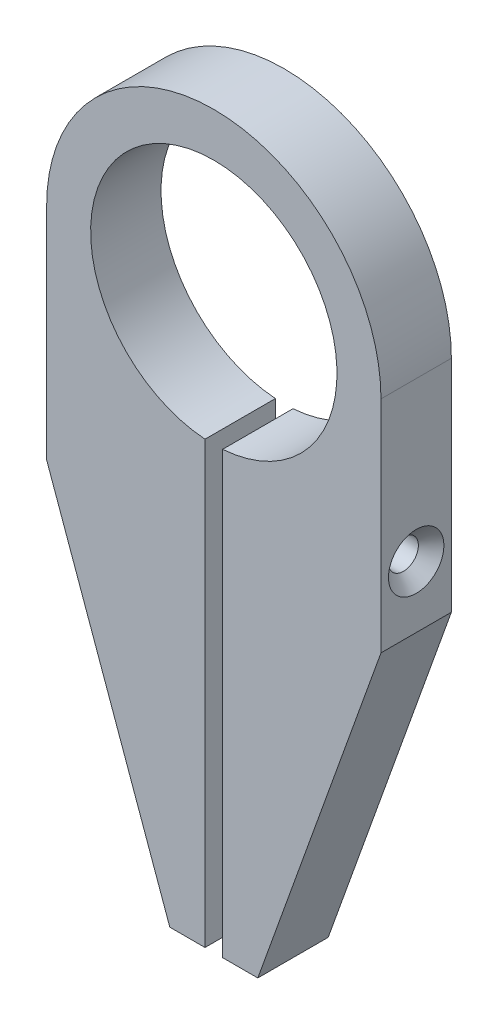
ISO-10303-21;
HEADER;
FILE_DESCRIPTION(('STEP AP214'),'2;1');
FILE_NAME('part.step','',(''),(''),'','','');
FILE_SCHEMA(('AUTOMOTIVE_DESIGN { 1 0 10303 214 1 1 1 1 }'));
ENDSEC;
DATA;
#1=APPLICATION_CONTEXT('core data for automotive mechanical design processes');
#2=APPLICATION_PROTOCOL_DEFINITION('international standard','automotive_design',2000,#1);
#3=PRODUCT_CONTEXT('',#1,'mechanical');
#4=PRODUCT('Part','Part','',(#3));
#5=PRODUCT_RELATED_PRODUCT_CATEGORY('part','',(#4));
#6=PRODUCT_DEFINITION_FORMATION('','',#4);
#7=PRODUCT_DEFINITION_CONTEXT('part definition',#1,'design');
#8=PRODUCT_DEFINITION('design','',#6,#7);
#9=PRODUCT_DEFINITION_SHAPE('','',#8);
#10=(LENGTH_UNIT() NAMED_UNIT(*) SI_UNIT(.MILLI.,.METRE.));
#11=(NAMED_UNIT(*) PLANE_ANGLE_UNIT() SI_UNIT($,.RADIAN.));
#12=(NAMED_UNIT(*) SI_UNIT($,.STERADIAN.) SOLID_ANGLE_UNIT());
#13=UNCERTAINTY_MEASURE_WITH_UNIT(LENGTH_MEASURE(1.E-05),#10,'distance_accuracy_value','');
#14=(GEOMETRIC_REPRESENTATION_CONTEXT(3) GLOBAL_UNCERTAINTY_ASSIGNED_CONTEXT((#13)) GLOBAL_UNIT_ASSIGNED_CONTEXT((#10,
#11,#12)) REPRESENTATION_CONTEXT('',''));
#15=CARTESIAN_POINT('',(0.,0.,0.));
#16=DIRECTION('',(0.,0.,1.));
#17=DIRECTION('',(1.,0.,0.));
#18=AXIS2_PLACEMENT_3D('',#15,#16,#17);
#19=CARTESIAN_POINT('',(-19.,0.,8.));
#20=DIRECTION('',(1.,0.,0.));
#21=DIRECTION('',(0.,1.,0.));
#22=AXIS2_PLACEMENT_3D('',#19,#20,#21);
#23=PLANE('',#22);
#24=DIRECTION('',(0.,-1.,0.));
#25=VECTOR('',#24,1.);
#26=CARTESIAN_POINT('',(-19.,0.,0.));
#27=LINE('',#26,#25);
#28=CARTESIAN_POINT('',(-19.,0.,0.));
#29=VERTEX_POINT('',#28);
#30=CARTESIAN_POINT('',(-19.,-25.,0.));
#31=VERTEX_POINT('',#30);
#32=EDGE_CURVE('E147',#29,#31,#27,.T.);
#33=ORIENTED_EDGE('',*,*,#32,.T.);
#34=DIRECTION('',(0.,0.,-1.));
#35=VECTOR('',#34,1.);
#36=CARTESIAN_POINT('',(-19.,-25.,8.));
#37=LINE('',#36,#35);
#38=CARTESIAN_POINT('',(-19.,-25.,8.));
#39=VERTEX_POINT('',#38);
#40=EDGE_CURVE('E144',#39,#31,#37,.T.);
#41=ORIENTED_EDGE('',*,*,#40,.F.);
#42=DIRECTION('',(0.,-1.,0.));
#43=VECTOR('',#42,1.);
#44=CARTESIAN_POINT('',(-19.,0.,8.));
#45=LINE('',#44,#43);
#46=CARTESIAN_POINT('',(-19.,0.,8.));
#47=VERTEX_POINT('',#46);
#48=EDGE_CURVE('E132',#47,#39,#45,.T.);
#49=ORIENTED_EDGE('',*,*,#48,.F.);
#50=DIRECTION('',(0.,0.,-1.));
#51=VECTOR('',#50,1.);
#52=CARTESIAN_POINT('',(-19.,0.,8.));
#53=LINE('',#52,#51);
#54=EDGE_CURVE('E148',#47,#29,#53,.T.);
#55=ORIENTED_EDGE('',*,*,#54,.T.);
#56=EDGE_LOOP('',(#33,#41,#49,#55));
#57=FACE_BOUND('',#56,.T.);
#58=CARTESIAN_POINT('',(-19.,-18.,4.));
#59=DIRECTION('',(-1.,0.,0.));
#60=DIRECTION('',(0.,0.,1.));
#61=AXIS2_PLACEMENT_3D('',#58,#59,#60);
#62=CIRCLE('',#61,1.24999999999999);
#63=CARTESIAN_POINT('',(-19.,-18.,5.24999999999999));
#64=VERTEX_POINT('',#63);
#65=EDGE_CURVE('E273',#64,#64,#62,.T.);
#66=ORIENTED_EDGE('',*,*,#65,.F.);
#67=EDGE_LOOP('',(#66));
#68=FACE_BOUND('',#67,.T.);
#69=ADVANCED_FACE('F50',(#57,#68),#23,.F.);
#70=CARTESIAN_POINT('',(-1.,0.,8.));
#71=DIRECTION('',(1.,0.,0.));
#72=DIRECTION('',(0.,1.,0.));
#73=AXIS2_PLACEMENT_3D('',#70,#71,#72);
#74=PLANE('',#73);
#75=CARTESIAN_POINT('',(-0.999999999999997,-18.,4.));
#76=DIRECTION('',(1.,0.,0.));
#77=DIRECTION('',(0.,1.,0.));
#78=AXIS2_PLACEMENT_3D('',#75,#76,#77);
#79=CIRCLE('',#78,1.24999999999999);
#80=CARTESIAN_POINT('',(-0.999999999999998,-16.75,4.));
#81=VERTEX_POINT('',#80);
#82=EDGE_CURVE('E276',#81,#81,#79,.T.);
#83=ORIENTED_EDGE('',*,*,#82,.F.);
#84=EDGE_LOOP('',(#83));
#85=FACE_BOUND('',#84,.T.);
#86=DIRECTION('',(0.,-1.,0.));
#87=VECTOR('',#86,1.);
#88=CARTESIAN_POINT('',(-1.,0.,0.));
#89=LINE('',#88,#87);
#90=CARTESIAN_POINT('',(-0.999999999999997,-13.9642400437689,0.));
#91=VERTEX_POINT('',#90);
#92=CARTESIAN_POINT('',(-0.999999999999984,-64.,0.));
#93=VERTEX_POINT('',#92);
#94=EDGE_CURVE('E156',#91,#93,#89,.T.);
#95=ORIENTED_EDGE('',*,*,#94,.F.);
#96=DIRECTION('',(0.,0.,-1.));
#97=VECTOR('',#96,1.);
#98=CARTESIAN_POINT('',(-0.999999999999997,-13.9642400437689,8.));
#99=LINE('',#98,#97);
#100=CARTESIAN_POINT('',(-0.999999999999997,-13.9642400437689,8.));
#101=VERTEX_POINT('',#100);
#102=EDGE_CURVE('E13',#101,#91,#99,.T.);
#103=ORIENTED_EDGE('',*,*,#102,.F.);
#104=DIRECTION('',(0.,-1.,0.));
#105=VECTOR('',#104,1.);
#106=CARTESIAN_POINT('',(-1.,0.,8.));
#107=LINE('',#106,#105);
#108=CARTESIAN_POINT('',(-0.999999999999984,-64.,8.));
#109=VERTEX_POINT('',#108);
#110=EDGE_CURVE('E181',#101,#109,#107,.T.);
#111=ORIENTED_EDGE('',*,*,#110,.T.);
#112=DIRECTION('',(0.,0.,-1.));
#113=VECTOR('',#112,1.);
#114=CARTESIAN_POINT('',(-0.999999999999984,-64.,8.));
#115=LINE('',#114,#113);
#116=EDGE_CURVE('E108',#109,#93,#115,.T.);
#117=ORIENTED_EDGE('',*,*,#116,.T.);
#118=EDGE_LOOP('',(#95,#103,#111,#117));
#119=FACE_BOUND('',#118,.T.);
#120=ADVANCED_FACE('F52',(#85,#119),#74,.T.);
#121=CARTESIAN_POINT('',(0.,0.,8.));
#122=DIRECTION('',(0.,0.,-1.));
#123=DIRECTION('',(-1.,0.,0.));
#124=AXIS2_PLACEMENT_3D('',#121,#122,#123);
#125=CYLINDRICAL_SURFACE('',#124,14.);
#126=CARTESIAN_POINT('',(0.,0.,0.));
#127=DIRECTION('',(0.,0.,1.));
#128=DIRECTION('',(1.,0.,0.));
#129=AXIS2_PLACEMENT_3D('',#126,#127,#128);
#130=CIRCLE('',#129,14.);
#131=CARTESIAN_POINT('',(1.,-13.9642400437689,0.));
#132=VERTEX_POINT('',#131);
#133=EDGE_CURVE('E159',#132,#91,#130,.T.);
#134=ORIENTED_EDGE('',*,*,#133,.F.);
#135=DIRECTION('',(0.,0.,-1.));
#136=VECTOR('',#135,1.);
#137=CARTESIAN_POINT('',(1.,-13.9642400437689,8.));
#138=LINE('',#137,#136);
#139=CARTESIAN_POINT('',(1.,-13.9642400437689,8.));
#140=VERTEX_POINT('',#139);
#141=EDGE_CURVE('E59',#140,#132,#138,.T.);
#142=ORIENTED_EDGE('',*,*,#141,.F.);
#143=CARTESIAN_POINT('',(0.,0.,8.));
#144=DIRECTION('',(0.,0.,1.));
#145=DIRECTION('',(1.,0.,0.));
#146=AXIS2_PLACEMENT_3D('',#143,#144,#145);
#147=CIRCLE('',#146,14.);
#148=EDGE_CURVE('E206',#140,#101,#147,.T.);
#149=ORIENTED_EDGE('',*,*,#148,.T.);
#150=ORIENTED_EDGE('',*,*,#102,.T.);
#151=EDGE_LOOP('',(#134,#142,#149,#150));
#152=FACE_BOUND('',#151,.T.);
#153=ADVANCED_FACE('F205',(#152),#125,.F.);
#154=CARTESIAN_POINT('',(1.,0.,8.));
#155=DIRECTION('',(1.,0.,0.));
#156=DIRECTION('',(0.,1.,0.));
#157=AXIS2_PLACEMENT_3D('',#154,#155,#156);
#158=PLANE('',#157);
#159=CARTESIAN_POINT('',(1.,-18.,4.));
#160=DIRECTION('',(1.,0.,0.));
#161=DIRECTION('',(0.,1.,0.));
#162=AXIS2_PLACEMENT_3D('',#159,#160,#161);
#163=CIRCLE('',#162,1.7);
#164=CARTESIAN_POINT('',(1.,-16.3,4.));
#165=VERTEX_POINT('',#164);
#166=EDGE_CURVE('E160',#165,#165,#163,.T.);
#167=ORIENTED_EDGE('',*,*,#166,.T.);
#168=EDGE_LOOP('',(#167));
#169=FACE_BOUND('',#168,.T.);
#170=DIRECTION('',(0.,-1.,0.));
#171=VECTOR('',#170,1.);
#172=CARTESIAN_POINT('',(1.,0.,0.));
#173=LINE('',#172,#171);
#174=CARTESIAN_POINT('',(1.00000000000001,-64.,0.));
#175=VERTEX_POINT('',#174);
#176=EDGE_CURVE('E163',#132,#175,#173,.T.);
#177=ORIENTED_EDGE('',*,*,#176,.T.);
#178=DIRECTION('',(0.,0.,-1.));
#179=VECTOR('',#178,1.);
#180=CARTESIAN_POINT('',(1.00000000000001,-64.,8.));
#181=LINE('',#180,#179);
#182=CARTESIAN_POINT('',(1.00000000000001,-64.,8.));
#183=VERTEX_POINT('',#182);
#184=EDGE_CURVE('E191',#183,#175,#181,.T.);
#185=ORIENTED_EDGE('',*,*,#184,.F.);
#186=DIRECTION('',(0.,-1.,0.));
#187=VECTOR('',#186,1.);
#188=CARTESIAN_POINT('',(1.,0.,8.));
#189=LINE('',#188,#187);
#190=EDGE_CURVE('E197',#140,#183,#189,.T.);
#191=ORIENTED_EDGE('',*,*,#190,.F.);
#192=ORIENTED_EDGE('',*,*,#141,.T.);
#193=EDGE_LOOP('',(#177,#185,#191,#192));
#194=FACE_BOUND('',#193,.T.);
#195=ADVANCED_FACE('F195',(#169,#194),#158,.F.);
#196=CARTESIAN_POINT('',(0.,-64.,8.));
#197=DIRECTION('',(0.,-1.,0.));
#198=DIRECTION('',(0.,0.,-1.));
#199=AXIS2_PLACEMENT_3D('',#196,#197,#198);
#200=PLANE('',#199);
#201=DIRECTION('',(-1.,0.,0.));
#202=VECTOR('',#201,1.);
#203=CARTESIAN_POINT('',(0.,-64.,0.));
#204=LINE('',#203,#202);
#205=CARTESIAN_POINT('',(5.00000000000001,-64.,0.));
#206=VERTEX_POINT('',#205);
#207=EDGE_CURVE('E166',#206,#175,#204,.T.);
#208=ORIENTED_EDGE('',*,*,#207,.F.);
#209=DIRECTION('',(0.,0.,-1.));
#210=VECTOR('',#209,1.);
#211=CARTESIAN_POINT('',(5.00000000000001,-64.,8.));
#212=LINE('',#211,#210);
#213=CARTESIAN_POINT('',(5.00000000000001,-64.,8.));
#214=VERTEX_POINT('',#213);
#215=EDGE_CURVE('E189',#214,#206,#212,.T.);
#216=ORIENTED_EDGE('',*,*,#215,.F.);
#217=DIRECTION('',(-1.,0.,0.));
#218=VECTOR('',#217,1.);
#219=CARTESIAN_POINT('',(0.,-64.,8.));
#220=LINE('',#219,#218);
#221=EDGE_CURVE('E216',#214,#183,#220,.T.);
#222=ORIENTED_EDGE('',*,*,#221,.T.);
#223=ORIENTED_EDGE('',*,*,#184,.T.);
#224=EDGE_LOOP('',(#208,#216,#222,#223));
#225=FACE_BOUND('',#224,.T.);
#226=ADVANCED_FACE('F290',(#225),#200,.T.);
#227=CARTESIAN_POINT('',(24.7810133954572,-8.89574839836924,8.));
#228=DIRECTION('',(0.941194670761707,-0.337864753606767,0.));
#229=DIRECTION('',(0.337864753606767,0.941194670761707,0.));
#230=AXIS2_PLACEMENT_3D('',#227,#228,#229);
#231=PLANE('',#230);
#232=DIRECTION('',(-0.337864753606767,-0.941194670761707,0.));
#233=VECTOR('',#232,1.);
#234=CARTESIAN_POINT('',(24.7810133954572,-8.89574839836924,0.));
#235=LINE('',#234,#233);
#236=CARTESIAN_POINT('',(19.,-25.,0.));
#237=VERTEX_POINT('',#236);
#238=EDGE_CURVE('E169',#237,#206,#235,.T.);
#239=ORIENTED_EDGE('',*,*,#238,.F.);
#240=DIRECTION('',(0.,0.,-1.));
#241=VECTOR('',#240,1.);
#242=CARTESIAN_POINT('',(19.,-25.,8.));
#243=LINE('',#242,#241);
#244=CARTESIAN_POINT('',(19.,-25.,8.));
#245=VERTEX_POINT('',#244);
#246=EDGE_CURVE('E187',#245,#237,#243,.T.);
#247=ORIENTED_EDGE('',*,*,#246,.F.);
#248=DIRECTION('',(-0.337864753606767,-0.941194670761707,0.));
#249=VECTOR('',#248,1.);
#250=CARTESIAN_POINT('',(24.7810133954572,-8.89574839836924,8.));
#251=LINE('',#250,#249);
#252=EDGE_CURVE('E219',#245,#214,#251,.T.);
#253=ORIENTED_EDGE('',*,*,#252,.T.);
#254=ORIENTED_EDGE('',*,*,#215,.T.);
#255=EDGE_LOOP('',(#239,#247,#253,#254));
#256=FACE_BOUND('',#255,.T.);
#257=ADVANCED_FACE('F231',(#256),#231,.T.);
#258=CARTESIAN_POINT('',(19.,0.,8.));
#259=DIRECTION('',(1.,0.,0.));
#260=DIRECTION('',(0.,1.,0.));
#261=AXIS2_PLACEMENT_3D('',#258,#259,#260);
#262=PLANE('',#261);
#263=CARTESIAN_POINT('',(19.,-18.,4.));
#264=DIRECTION('',(1.,0.,0.));
#265=DIRECTION('',(0.,0.,-1.));
#266=AXIS2_PLACEMENT_3D('',#263,#264,#265);
#267=CIRCLE('',#266,3.15);
#268=CARTESIAN_POINT('',(19.,-18.,0.85));
#269=VERTEX_POINT('',#268);
#270=EDGE_CURVE('E277',#269,#269,#267,.T.);
#271=ORIENTED_EDGE('',*,*,#270,.F.);
#272=EDGE_LOOP('',(#271));
#273=FACE_BOUND('',#272,.T.);
#274=DIRECTION('',(0.,-1.,0.));
#275=VECTOR('',#274,1.);
#276=CARTESIAN_POINT('',(19.,0.,0.));
#277=LINE('',#276,#275);
#278=CARTESIAN_POINT('',(19.,0.,0.));
#279=VERTEX_POINT('',#278);
#280=EDGE_CURVE('E172',#279,#237,#277,.T.);
#281=ORIENTED_EDGE('',*,*,#280,.F.);
#282=DIRECTION('',(0.,0.,-1.));
#283=VECTOR('',#282,1.);
#284=CARTESIAN_POINT('',(19.,0.,8.));
#285=LINE('',#284,#283);
#286=CARTESIAN_POINT('',(19.,0.,8.));
#287=VERTEX_POINT('',#286);
#288=EDGE_CURVE('E185',#287,#279,#285,.T.);
#289=ORIENTED_EDGE('',*,*,#288,.F.);
#290=DIRECTION('',(0.,-1.,0.));
#291=VECTOR('',#290,1.);
#292=CARTESIAN_POINT('',(19.,0.,8.));
#293=LINE('',#292,#291);
#294=EDGE_CURVE('E222',#287,#245,#293,.T.);
#295=ORIENTED_EDGE('',*,*,#294,.T.);
#296=ORIENTED_EDGE('',*,*,#246,.T.);
#297=EDGE_LOOP('',(#281,#289,#295,#296));
#298=FACE_BOUND('',#297,.T.);
#299=ADVANCED_FACE('F226',(#273,#298),#262,.T.);
#300=CARTESIAN_POINT('',(0.,0.,8.));
#301=DIRECTION('',(0.,0.,-1.));
#302=DIRECTION('',(-1.,0.,0.));
#303=AXIS2_PLACEMENT_3D('',#300,#301,#302);
#304=CYLINDRICAL_SURFACE('',#303,19.);
#305=CARTESIAN_POINT('',(0.,0.,0.));
#306=DIRECTION('',(0.,0.,1.));
#307=DIRECTION('',(1.,0.,0.));
#308=AXIS2_PLACEMENT_3D('',#305,#306,#307);
#309=CIRCLE('',#308,19.);
#310=EDGE_CURVE('E175',#279,#29,#309,.T.);
#311=ORIENTED_EDGE('',*,*,#310,.T.);
#312=ORIENTED_EDGE('',*,*,#54,.F.);
#313=CARTESIAN_POINT('',(0.,0.,8.));
#314=DIRECTION('',(0.,0.,1.));
#315=DIRECTION('',(1.,0.,0.));
#316=AXIS2_PLACEMENT_3D('',#313,#314,#315);
#317=CIRCLE('',#316,19.);
#318=EDGE_CURVE('E139',#287,#47,#317,.T.);
#319=ORIENTED_EDGE('',*,*,#318,.F.);
#320=ORIENTED_EDGE('',*,*,#288,.T.);
#321=EDGE_LOOP('',(#311,#312,#319,#320));
#322=FACE_BOUND('',#321,.T.);
#323=ADVANCED_FACE('F234',(#322),#304,.T.);
#324=CARTESIAN_POINT('',(-24.7810133954572,-8.89574839836924,8.));
#325=DIRECTION('',(0.941194670761708,0.337864753606766,0.));
#326=DIRECTION('',(-0.337864753606766,0.941194670761708,0.));
#327=AXIS2_PLACEMENT_3D('',#324,#325,#326);
#328=PLANE('',#327);
#329=DIRECTION('',(0.337864753606766,-0.941194670761708,0.));
#330=VECTOR('',#329,1.);
#331=CARTESIAN_POINT('',(-24.7810133954572,-8.89574839836924,0.));
#332=LINE('',#331,#330);
#333=CARTESIAN_POINT('',(-5.00000000000001,-64.,0.));
#334=VERTEX_POINT('',#333);
#335=EDGE_CURVE('E101',#31,#334,#332,.T.);
#336=ORIENTED_EDGE('',*,*,#335,.T.);
#337=DIRECTION('',(0.,0.,-1.));
#338=VECTOR('',#337,1.);
#339=CARTESIAN_POINT('',(-5.00000000000001,-64.,8.));
#340=LINE('',#339,#338);
#341=CARTESIAN_POINT('',(-5.00000000000001,-64.,8.));
#342=VERTEX_POINT('',#341);
#343=EDGE_CURVE('E149',#342,#334,#340,.T.);
#344=ORIENTED_EDGE('',*,*,#343,.F.);
#345=DIRECTION('',(0.337864753606766,-0.941194670761708,0.));
#346=VECTOR('',#345,1.);
#347=CARTESIAN_POINT('',(-24.7810133954572,-8.89574839836924,8.));
#348=LINE('',#347,#346);
#349=EDGE_CURVE('E136',#39,#342,#348,.T.);
#350=ORIENTED_EDGE('',*,*,#349,.F.);
#351=ORIENTED_EDGE('',*,*,#40,.T.);
#352=EDGE_LOOP('',(#336,#344,#350,#351));
#353=FACE_BOUND('',#352,.T.);
#354=ADVANCED_FACE('F151',(#353),#328,.F.);
#355=CARTESIAN_POINT('',(0.,-64.,8.));
#356=DIRECTION('',(0.,1.,0.));
#357=DIRECTION('',(0.,0.,1.));
#358=AXIS2_PLACEMENT_3D('',#355,#356,#357);
#359=PLANE('',#358);
#360=DIRECTION('',(1.,0.,0.));
#361=VECTOR('',#360,1.);
#362=CARTESIAN_POINT('',(0.,-64.,0.));
#363=LINE('',#362,#361);
#364=EDGE_CURVE('E179',#334,#93,#363,.T.);
#365=ORIENTED_EDGE('',*,*,#364,.T.);
#366=ORIENTED_EDGE('',*,*,#116,.F.);
#367=DIRECTION('',(1.,0.,0.));
#368=VECTOR('',#367,1.);
#369=CARTESIAN_POINT('',(0.,-64.,8.));
#370=LINE('',#369,#368);
#371=EDGE_CURVE('E67',#342,#109,#370,.T.);
#372=ORIENTED_EDGE('',*,*,#371,.F.);
#373=ORIENTED_EDGE('',*,*,#343,.T.);
#374=EDGE_LOOP('',(#365,#366,#372,#373));
#375=FACE_BOUND('',#374,.T.);
#376=ADVANCED_FACE('F209',(#375),#359,.F.);
#377=CARTESIAN_POINT('',(0.,0.,8.));
#378=DIRECTION('',(0.,0.,1.));
#379=DIRECTION('',(1.,0.,0.));
#380=AXIS2_PLACEMENT_3D('',#377,#378,#379);
#381=PLANE('',#380);
#382=ORIENTED_EDGE('',*,*,#110,.F.);
#383=ORIENTED_EDGE('',*,*,#148,.F.);
#384=ORIENTED_EDGE('',*,*,#190,.T.);
#385=ORIENTED_EDGE('',*,*,#221,.F.);
#386=ORIENTED_EDGE('',*,*,#252,.F.);
#387=ORIENTED_EDGE('',*,*,#294,.F.);
#388=ORIENTED_EDGE('',*,*,#318,.T.);
#389=ORIENTED_EDGE('',*,*,#48,.T.);
#390=ORIENTED_EDGE('',*,*,#349,.T.);
#391=ORIENTED_EDGE('',*,*,#371,.T.);
#392=EDGE_LOOP('',(#382,#383,#384,#385,#386,#387,#388,#389,#390,#391));
#393=FACE_BOUND('',#392,.T.);
#394=ADVANCED_FACE('F134',(#393),#381,.T.);
#395=CARTESIAN_POINT('',(0.,0.,0.));
#396=DIRECTION('',(0.,0.,1.));
#397=DIRECTION('',(1.,0.,0.));
#398=AXIS2_PLACEMENT_3D('',#395,#396,#397);
#399=PLANE('',#398);
#400=ORIENTED_EDGE('',*,*,#94,.T.);
#401=ORIENTED_EDGE('',*,*,#364,.F.);
#402=ORIENTED_EDGE('',*,*,#335,.F.);
#403=ORIENTED_EDGE('',*,*,#32,.F.);
#404=ORIENTED_EDGE('',*,*,#310,.F.);
#405=ORIENTED_EDGE('',*,*,#280,.T.);
#406=ORIENTED_EDGE('',*,*,#238,.T.);
#407=ORIENTED_EDGE('',*,*,#207,.T.);
#408=ORIENTED_EDGE('',*,*,#176,.F.);
#409=ORIENTED_EDGE('',*,*,#133,.T.);
#410=EDGE_LOOP('',(#400,#401,#402,#403,#404,#405,#406,#407,#408,#409));
#411=FACE_BOUND('',#410,.T.);
#412=ADVANCED_FACE('F203',(#411),#399,.F.);
#413=CARTESIAN_POINT('',(19.,-18.,4.));
#414=DIRECTION('',(1.,0.,0.));
#415=DIRECTION('',(0.,0.,-1.));
#416=AXIS2_PLACEMENT_3D('',#413,#414,#415);
#417=CYLINDRICAL_SURFACE('',#416,1.7);
#418=ORIENTED_EDGE('',*,*,#166,.F.);
#419=EDGE_LOOP('',(#418));
#420=FACE_BOUND('',#419,.T.);
#421=CARTESIAN_POINT('',(17.55,-18.,4.));
#422=DIRECTION('',(1.,0.,0.));
#423=DIRECTION('',(0.,0.,-1.));
#424=AXIS2_PLACEMENT_3D('',#421,#422,#423);
#425=CIRCLE('',#424,1.7);
#426=CARTESIAN_POINT('',(17.55,-18.,2.3));
#427=VERTEX_POINT('',#426);
#428=EDGE_CURVE('E280',#427,#427,#425,.T.);
#429=ORIENTED_EDGE('',*,*,#428,.T.);
#430=EDGE_LOOP('',(#429));
#431=FACE_BOUND('',#430,.T.);
#432=ADVANCED_FACE('F255',(#420,#431),#417,.F.);
#433=CARTESIAN_POINT('',(19.,-18.,4.));
#434=DIRECTION('',(1.,0.,0.));
#435=DIRECTION('',(0.,0.,-1.));
#436=AXIS2_PLACEMENT_3D('',#433,#434,#435);
#437=CONICAL_SURFACE('',#436,3.15,0.78539816339745);
#438=ORIENTED_EDGE('',*,*,#428,.F.);
#439=EDGE_LOOP('',(#438));
#440=FACE_BOUND('',#439,.T.);
#441=ORIENTED_EDGE('',*,*,#270,.T.);
#442=EDGE_LOOP('',(#441));
#443=FACE_BOUND('',#442,.T.);
#444=ADVANCED_FACE('F260',(#440,#443),#437,.F.);
#445=CARTESIAN_POINT('',(-19.,-18.,4.));
#446=DIRECTION('',(-1.,0.,0.));
#447=DIRECTION('',(0.,0.,1.));
#448=AXIS2_PLACEMENT_3D('',#445,#446,#447);
#449=CYLINDRICAL_SURFACE('',#448,1.24999999999999);
#450=ORIENTED_EDGE('',*,*,#65,.T.);
#451=EDGE_LOOP('',(#450));
#452=FACE_BOUND('',#451,.T.);
#453=ORIENTED_EDGE('',*,*,#82,.T.);
#454=EDGE_LOOP('',(#453));
#455=FACE_BOUND('',#454,.T.);
#456=ADVANCED_FACE('F264',(#452,#455),#449,.F.);
#457=CLOSED_SHELL('',(#69,#120,#153,#195,#226,#257,#299,#323,#354,#376,#394,#412,#432,#444,#456));
#458=MANIFOLD_SOLID_BREP('B2',#457);
#459=ADVANCED_BREP_SHAPE_REPRESENTATION('',(#18,#458),#14);
#460=SHAPE_DEFINITION_REPRESENTATION(#9,#459);
ENDSEC;
END-ISO-10303-21;
